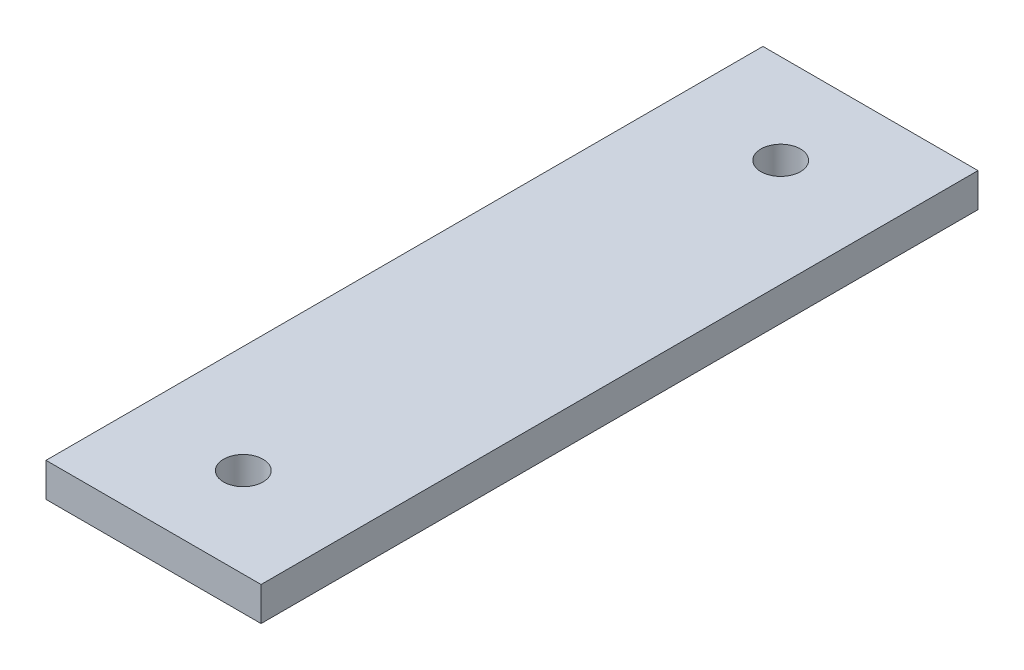
ISO-10303-21;
HEADER;
FILE_DESCRIPTION(('STEP AP214'),'2;1');
FILE_NAME('part.step','',(''),(''),'','','');
FILE_SCHEMA(('AUTOMOTIVE_DESIGN { 1 0 10303 214 1 1 1 1 }'));
ENDSEC;
DATA;
#1=APPLICATION_CONTEXT('core data for automotive mechanical design processes');
#2=APPLICATION_PROTOCOL_DEFINITION('international standard','automotive_design',2000,#1);
#3=PRODUCT_CONTEXT('',#1,'mechanical');
#4=PRODUCT('Part','Part','',(#3));
#5=PRODUCT_RELATED_PRODUCT_CATEGORY('part','',(#4));
#6=PRODUCT_DEFINITION_FORMATION('','',#4);
#7=PRODUCT_DEFINITION_CONTEXT('part definition',#1,'design');
#8=PRODUCT_DEFINITION('design','',#6,#7);
#9=PRODUCT_DEFINITION_SHAPE('','',#8);
#10=(LENGTH_UNIT() NAMED_UNIT(*) SI_UNIT(.MILLI.,.METRE.));
#11=(NAMED_UNIT(*) PLANE_ANGLE_UNIT() SI_UNIT($,.RADIAN.));
#12=(NAMED_UNIT(*) SI_UNIT($,.STERADIAN.) SOLID_ANGLE_UNIT());
#13=UNCERTAINTY_MEASURE_WITH_UNIT(LENGTH_MEASURE(1.E-05),#10,'distance_accuracy_value','');
#14=(GEOMETRIC_REPRESENTATION_CONTEXT(3) GLOBAL_UNCERTAINTY_ASSIGNED_CONTEXT((#13)) GLOBAL_UNIT_ASSIGNED_CONTEXT((#10,
#11,#12)) REPRESENTATION_CONTEXT('',''));
#15=CARTESIAN_POINT('',(0.,0.,0.));
#16=DIRECTION('',(0.,0.,1.));
#17=DIRECTION('',(1.,0.,0.));
#18=AXIS2_PLACEMENT_3D('',#15,#16,#17);
#19=CARTESIAN_POINT('',(-12.7,6.,102.));
#20=DIRECTION('',(1.,0.,0.));
#21=DIRECTION('',(0.,0.,-1.));
#22=AXIS2_PLACEMENT_3D('',#19,#20,#21);
#23=PLANE('',#22);
#24=DIRECTION('',(0.,0.,1.));
#25=VECTOR('',#24,1.);
#26=CARTESIAN_POINT('',(-12.7,0.,102.));
#27=LINE('',#26,#25);
#28=CARTESIAN_POINT('',(-12.7,0.,-25.));
#29=VERTEX_POINT('',#28);
#30=CARTESIAN_POINT('',(-12.7,0.,102.));
#31=VERTEX_POINT('',#30);
#32=EDGE_CURVE('E96',#29,#31,#27,.T.);
#33=ORIENTED_EDGE('',*,*,#32,.T.);
#34=DIRECTION('',(0.,-1.,0.));
#35=VECTOR('',#34,1.);
#36=CARTESIAN_POINT('',(-12.7,6.,102.));
#37=LINE('',#36,#35);
#38=CARTESIAN_POINT('',(-12.7,6.,102.));
#39=VERTEX_POINT('',#38);
#40=EDGE_CURVE('E11',#39,#31,#37,.T.);
#41=ORIENTED_EDGE('',*,*,#40,.F.);
#42=DIRECTION('',(0.,0.,1.));
#43=VECTOR('',#42,1.);
#44=CARTESIAN_POINT('',(-12.7,6.,102.));
#45=LINE('',#44,#43);
#46=CARTESIAN_POINT('',(-12.7,6.,-25.));
#47=VERTEX_POINT('',#46);
#48=EDGE_CURVE('E84',#47,#39,#45,.T.);
#49=ORIENTED_EDGE('',*,*,#48,.F.);
#50=DIRECTION('',(0.,-1.,0.));
#51=VECTOR('',#50,1.);
#52=CARTESIAN_POINT('',(-12.7,6.,-25.));
#53=LINE('',#52,#51);
#54=EDGE_CURVE('E92',#47,#29,#53,.T.);
#55=ORIENTED_EDGE('',*,*,#54,.T.);
#56=EDGE_LOOP('',(#33,#41,#49,#55));
#57=FACE_BOUND('',#56,.T.);
#58=ADVANCED_FACE('F33',(#57),#23,.F.);
#59=CARTESIAN_POINT('',(-12.7,6.,102.));
#60=DIRECTION('',(0.,0.,-1.));
#61=DIRECTION('',(-1.,0.,0.));
#62=AXIS2_PLACEMENT_3D('',#59,#60,#61);
#63=PLANE('',#62);
#64=DIRECTION('',(1.,0.,0.));
#65=VECTOR('',#64,1.);
#66=CARTESIAN_POINT('',(-12.7,0.,102.));
#67=LINE('',#66,#65);
#68=CARTESIAN_POINT('',(25.4,0.,102.));
#69=VERTEX_POINT('',#68);
#70=EDGE_CURVE('E88',#31,#69,#67,.T.);
#71=ORIENTED_EDGE('',*,*,#70,.T.);
#72=DIRECTION('',(0.,-1.,0.));
#73=VECTOR('',#72,1.);
#74=CARTESIAN_POINT('',(25.4,6.,102.));
#75=LINE('',#74,#73);
#76=CARTESIAN_POINT('',(25.4,6.,102.));
#77=VERTEX_POINT('',#76);
#78=EDGE_CURVE('E41',#77,#69,#75,.T.);
#79=ORIENTED_EDGE('',*,*,#78,.F.);
#80=DIRECTION('',(1.,0.,0.));
#81=VECTOR('',#80,1.);
#82=CARTESIAN_POINT('',(-12.7,6.,102.));
#83=LINE('',#82,#81);
#84=EDGE_CURVE('E79',#39,#77,#83,.T.);
#85=ORIENTED_EDGE('',*,*,#84,.F.);
#86=ORIENTED_EDGE('',*,*,#40,.T.);
#87=EDGE_LOOP('',(#71,#79,#85,#86));
#88=FACE_BOUND('',#87,.T.);
#89=ADVANCED_FACE('F87',(#88),#63,.F.);
#90=CARTESIAN_POINT('',(25.4,6.,102.));
#91=DIRECTION('',(-1.,0.,0.));
#92=DIRECTION('',(0.,0.,1.));
#93=AXIS2_PLACEMENT_3D('',#90,#91,#92);
#94=PLANE('',#93);
#95=DIRECTION('',(0.,0.,-1.));
#96=VECTOR('',#95,1.);
#97=CARTESIAN_POINT('',(25.4,0.,102.));
#98=LINE('',#97,#96);
#99=CARTESIAN_POINT('',(25.4,0.,-25.));
#100=VERTEX_POINT('',#99);
#101=EDGE_CURVE('E66',#69,#100,#98,.T.);
#102=ORIENTED_EDGE('',*,*,#101,.T.);
#103=DIRECTION('',(0.,-1.,0.));
#104=VECTOR('',#103,1.);
#105=CARTESIAN_POINT('',(25.4,6.,-25.));
#106=LINE('',#105,#104);
#107=CARTESIAN_POINT('',(25.4,6.,-25.));
#108=VERTEX_POINT('',#107);
#109=EDGE_CURVE('E89',#108,#100,#106,.T.);
#110=ORIENTED_EDGE('',*,*,#109,.F.);
#111=DIRECTION('',(0.,0.,-1.));
#112=VECTOR('',#111,1.);
#113=CARTESIAN_POINT('',(25.4,6.,102.));
#114=LINE('',#113,#112);
#115=EDGE_CURVE('E82',#77,#108,#114,.T.);
#116=ORIENTED_EDGE('',*,*,#115,.F.);
#117=ORIENTED_EDGE('',*,*,#78,.T.);
#118=EDGE_LOOP('',(#102,#110,#116,#117));
#119=FACE_BOUND('',#118,.T.);
#120=ADVANCED_FACE('F90',(#119),#94,.F.);
#121=CARTESIAN_POINT('',(-12.7,6.,-25.));
#122=DIRECTION('',(0.,0.,1.));
#123=DIRECTION('',(1.,0.,0.));
#124=AXIS2_PLACEMENT_3D('',#121,#122,#123);
#125=PLANE('',#124);
#126=DIRECTION('',(-1.,0.,0.));
#127=VECTOR('',#126,1.);
#128=CARTESIAN_POINT('',(-12.7,0.,-25.));
#129=LINE('',#128,#127);
#130=EDGE_CURVE('E72',#100,#29,#129,.T.);
#131=ORIENTED_EDGE('',*,*,#130,.T.);
#132=ORIENTED_EDGE('',*,*,#54,.F.);
#133=DIRECTION('',(-1.,0.,0.));
#134=VECTOR('',#133,1.);
#135=CARTESIAN_POINT('',(-12.7,6.,-25.));
#136=LINE('',#135,#134);
#137=EDGE_CURVE('E49',#108,#47,#136,.T.);
#138=ORIENTED_EDGE('',*,*,#137,.F.);
#139=ORIENTED_EDGE('',*,*,#109,.T.);
#140=EDGE_LOOP('',(#131,#132,#138,#139));
#141=FACE_BOUND('',#140,.T.);
#142=ADVANCED_FACE('F104',(#141),#125,.F.);
#143=CARTESIAN_POINT('',(0.,6.,0.));
#144=DIRECTION('',(0.,-1.,0.));
#145=DIRECTION('',(0.,0.,-1.));
#146=AXIS2_PLACEMENT_3D('',#143,#144,#145);
#147=PLANE('',#146);
#148=CARTESIAN_POINT('',(6.35,6.,-9.1));
#149=DIRECTION('',(0.,1.,0.));
#150=DIRECTION('',(0.,0.,1.));
#151=AXIS2_PLACEMENT_3D('',#148,#149,#150);
#152=CIRCLE('',#151,3.50000000000001);
#153=CARTESIAN_POINT('',(6.35,6.,-5.6));
#154=VERTEX_POINT('',#153);
#155=EDGE_CURVE('E116',#154,#154,#152,.T.);
#156=ORIENTED_EDGE('',*,*,#155,.F.);
#157=EDGE_LOOP('',(#156));
#158=FACE_BOUND('',#157,.T.);
#159=CARTESIAN_POINT('',(6.35000000000001,6.,86.1));
#160=DIRECTION('',(0.,1.,0.));
#161=DIRECTION('',(0.,0.,-1.));
#162=AXIS2_PLACEMENT_3D('',#159,#160,#161);
#163=CIRCLE('',#162,3.5);
#164=CARTESIAN_POINT('',(6.35000000000001,6.,82.6));
#165=VERTEX_POINT('',#164);
#166=EDGE_CURVE('E110',#165,#165,#163,.T.);
#167=ORIENTED_EDGE('',*,*,#166,.F.);
#168=EDGE_LOOP('',(#167));
#169=FACE_BOUND('',#168,.T.);
#170=ORIENTED_EDGE('',*,*,#48,.T.);
#171=ORIENTED_EDGE('',*,*,#84,.T.);
#172=ORIENTED_EDGE('',*,*,#115,.T.);
#173=ORIENTED_EDGE('',*,*,#137,.T.);
#174=EDGE_LOOP('',(#170,#171,#172,#173));
#175=FACE_BOUND('',#174,.T.);
#176=ADVANCED_FACE('F80',(#158,#169,#175),#147,.F.);
#177=CARTESIAN_POINT('',(0.,0.,0.));
#178=DIRECTION('',(0.,-1.,0.));
#179=DIRECTION('',(0.,0.,-1.));
#180=AXIS2_PLACEMENT_3D('',#177,#178,#179);
#181=PLANE('',#180);
#182=CARTESIAN_POINT('',(6.35,0.,-9.1));
#183=DIRECTION('',(0.,1.,0.));
#184=DIRECTION('',(0.,0.,1.));
#185=AXIS2_PLACEMENT_3D('',#182,#183,#184);
#186=CIRCLE('',#185,3.50000000000001);
#187=CARTESIAN_POINT('',(6.35,0.,-5.6));
#188=VERTEX_POINT('',#187);
#189=EDGE_CURVE('E99',#188,#188,#186,.T.);
#190=ORIENTED_EDGE('',*,*,#189,.T.);
#191=EDGE_LOOP('',(#190));
#192=FACE_BOUND('',#191,.T.);
#193=CARTESIAN_POINT('',(6.35000000000001,0.,86.1));
#194=DIRECTION('',(0.,1.,0.));
#195=DIRECTION('',(0.,0.,-1.));
#196=AXIS2_PLACEMENT_3D('',#193,#194,#195);
#197=CIRCLE('',#196,3.5);
#198=CARTESIAN_POINT('',(6.35000000000001,0.,82.6));
#199=VERTEX_POINT('',#198);
#200=EDGE_CURVE('E113',#199,#199,#197,.T.);
#201=ORIENTED_EDGE('',*,*,#200,.T.);
#202=EDGE_LOOP('',(#201));
#203=FACE_BOUND('',#202,.T.);
#204=ORIENTED_EDGE('',*,*,#32,.F.);
#205=ORIENTED_EDGE('',*,*,#130,.F.);
#206=ORIENTED_EDGE('',*,*,#101,.F.);
#207=ORIENTED_EDGE('',*,*,#70,.F.);
#208=EDGE_LOOP('',(#204,#205,#206,#207));
#209=FACE_BOUND('',#208,.T.);
#210=ADVANCED_FACE('F107',(#192,#203,#209),#181,.T.);
#211=CARTESIAN_POINT('',(6.35000000000001,0.,86.1));
#212=DIRECTION('',(0.,1.,0.));
#213=DIRECTION('',(0.,0.,1.));
#214=AXIS2_PLACEMENT_3D('',#211,#212,#213);
#215=CYLINDRICAL_SURFACE('',#214,3.5);
#216=ORIENTED_EDGE('',*,*,#200,.F.);
#217=EDGE_LOOP('',(#216));
#218=FACE_BOUND('',#217,.T.);
#219=ORIENTED_EDGE('',*,*,#166,.T.);
#220=EDGE_LOOP('',(#219));
#221=FACE_BOUND('',#220,.T.);
#222=ADVANCED_FACE('F127',(#218,#221),#215,.F.);
#223=CARTESIAN_POINT('',(6.35,0.,-9.1));
#224=DIRECTION('',(0.,1.,0.));
#225=DIRECTION('',(0.,0.,1.));
#226=AXIS2_PLACEMENT_3D('',#223,#224,#225);
#227=CYLINDRICAL_SURFACE('',#226,3.50000000000001);
#228=ORIENTED_EDGE('',*,*,#189,.F.);
#229=EDGE_LOOP('',(#228));
#230=FACE_BOUND('',#229,.T.);
#231=ORIENTED_EDGE('',*,*,#155,.T.);
#232=EDGE_LOOP('',(#231));
#233=FACE_BOUND('',#232,.T.);
#234=ADVANCED_FACE('F124',(#230,#233),#227,.F.);
#235=CLOSED_SHELL('',(#58,#89,#120,#142,#176,#210,#222,#234));
#236=MANIFOLD_SOLID_BREP('B2',#235);
#237=ADVANCED_BREP_SHAPE_REPRESENTATION('',(#18,#236),#14);
#238=SHAPE_DEFINITION_REPRESENTATION(#9,#237);
ENDSEC;
END-ISO-10303-21;
